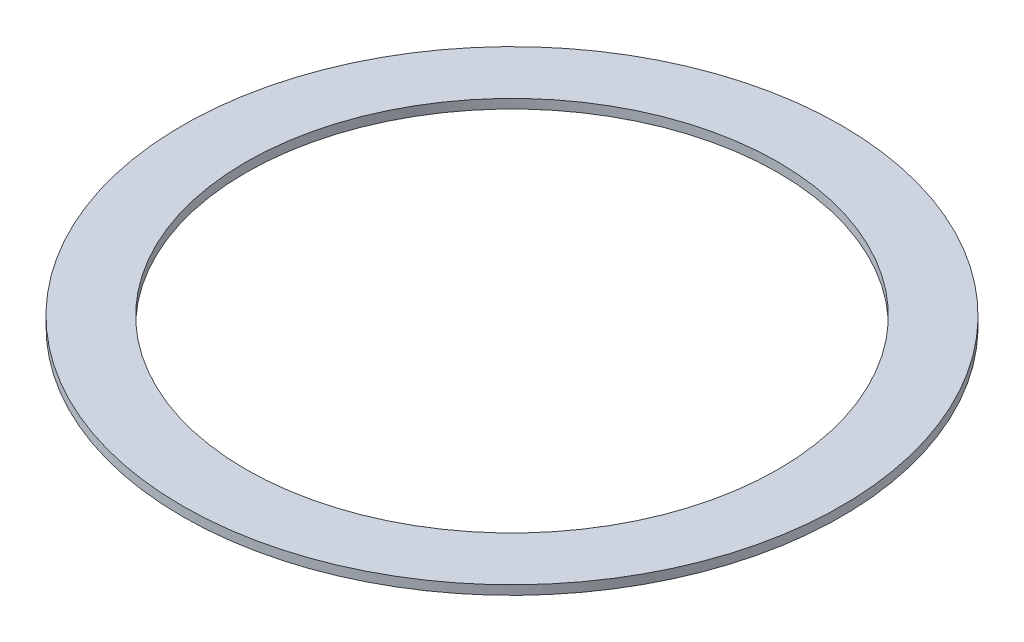
ISO-10303-21;
HEADER;
FILE_DESCRIPTION(('STEP AP214'),'2;1');
FILE_NAME('part.step','',(''),(''),'','','');
FILE_SCHEMA(('AUTOMOTIVE_DESIGN { 1 0 10303 214 1 1 1 1 }'));
ENDSEC;
DATA;
#1=APPLICATION_CONTEXT('core data for automotive mechanical design processes');
#2=APPLICATION_PROTOCOL_DEFINITION('international standard','automotive_design',2000,#1);
#3=PRODUCT_CONTEXT('',#1,'mechanical');
#4=PRODUCT('Part','Part','',(#3));
#5=PRODUCT_RELATED_PRODUCT_CATEGORY('part','',(#4));
#6=PRODUCT_DEFINITION_FORMATION('','',#4);
#7=PRODUCT_DEFINITION_CONTEXT('part definition',#1,'design');
#8=PRODUCT_DEFINITION('design','',#6,#7);
#9=PRODUCT_DEFINITION_SHAPE('','',#8);
#10=(LENGTH_UNIT() NAMED_UNIT(*) SI_UNIT(.MILLI.,.METRE.));
#11=(NAMED_UNIT(*) PLANE_ANGLE_UNIT() SI_UNIT($,.RADIAN.));
#12=(NAMED_UNIT(*) SI_UNIT($,.STERADIAN.) SOLID_ANGLE_UNIT());
#13=UNCERTAINTY_MEASURE_WITH_UNIT(LENGTH_MEASURE(1.E-05),#10,'distance_accuracy_value','');
#14=(GEOMETRIC_REPRESENTATION_CONTEXT(3) GLOBAL_UNCERTAINTY_ASSIGNED_CONTEXT((#13)) GLOBAL_UNIT_ASSIGNED_CONTEXT((#10,
#11,#12)) REPRESENTATION_CONTEXT('',''));
#15=CARTESIAN_POINT('',(0.,0.,0.));
#16=DIRECTION('',(0.,0.,1.));
#17=DIRECTION('',(1.,0.,0.));
#18=AXIS2_PLACEMENT_3D('',#15,#16,#17);
#19=CARTESIAN_POINT('',(0.,10.,0.));
#20=DIRECTION('',(0.,1.,0.));
#21=DIRECTION('',(0.,0.,1.));
#22=AXIS2_PLACEMENT_3D('',#19,#20,#21);
#23=PLANE('',#22);
#24=CARTESIAN_POINT('',(0.,10.,0.));
#25=DIRECTION('',(0.,1.,0.));
#26=DIRECTION('',(0.,0.,1.));
#27=AXIS2_PLACEMENT_3D('',#24,#25,#26);
#28=CIRCLE('',#27,359.096137885452);
#29=CARTESIAN_POINT('',(0.,10.,359.096137885452));
#30=VERTEX_POINT('',#29);
#31=EDGE_CURVE('E10',#30,#30,#28,.T.);
#32=ORIENTED_EDGE('',*,*,#31,.T.);
#33=EDGE_LOOP('',(#32));
#34=FACE_BOUND('',#33,.T.);
#35=CARTESIAN_POINT('',(0.,10.,0.));
#36=DIRECTION('',(0.,1.,0.));
#37=DIRECTION('',(0.,0.,1.));
#38=AXIS2_PLACEMENT_3D('',#35,#36,#37);
#39=CIRCLE('',#38,290.);
#40=CARTESIAN_POINT('',(0.,10.,290.));
#41=VERTEX_POINT('',#40);
#42=EDGE_CURVE('E41',#41,#41,#39,.T.);
#43=ORIENTED_EDGE('',*,*,#42,.F.);
#44=EDGE_LOOP('',(#43));
#45=FACE_BOUND('',#44,.T.);
#46=ADVANCED_FACE('F30',(#34,#45),#23,.T.);
#47=CARTESIAN_POINT('',(0.,0.,0.));
#48=DIRECTION('',(0.,1.,0.));
#49=DIRECTION('',(0.,0.,1.));
#50=AXIS2_PLACEMENT_3D('',#47,#48,#49);
#51=PLANE('',#50);
#52=CARTESIAN_POINT('',(0.,0.,0.));
#53=DIRECTION('',(0.,1.,0.));
#54=DIRECTION('',(0.,0.,1.));
#55=AXIS2_PLACEMENT_3D('',#52,#53,#54);
#56=CIRCLE('',#55,359.096137885452);
#57=CARTESIAN_POINT('',(0.,0.,359.096137885452));
#58=VERTEX_POINT('',#57);
#59=EDGE_CURVE('E34',#58,#58,#56,.T.);
#60=ORIENTED_EDGE('',*,*,#59,.F.);
#61=EDGE_LOOP('',(#60));
#62=FACE_BOUND('',#61,.T.);
#63=CARTESIAN_POINT('',(0.,0.,0.));
#64=DIRECTION('',(0.,1.,0.));
#65=DIRECTION('',(0.,0.,1.));
#66=AXIS2_PLACEMENT_3D('',#63,#64,#65);
#67=CIRCLE('',#66,290.);
#68=CARTESIAN_POINT('',(0.,0.,290.));
#69=VERTEX_POINT('',#68);
#70=EDGE_CURVE('E43',#69,#69,#67,.T.);
#71=ORIENTED_EDGE('',*,*,#70,.T.);
#72=EDGE_LOOP('',(#71));
#73=FACE_BOUND('',#72,.T.);
#74=ADVANCED_FACE('F53',(#62,#73),#51,.F.);
#75=CARTESIAN_POINT('',(0.,10.,0.));
#76=DIRECTION('',(0.,-1.,0.));
#77=DIRECTION('',(0.,0.,-1.));
#78=AXIS2_PLACEMENT_3D('',#75,#76,#77);
#79=CYLINDRICAL_SURFACE('',#78,359.096137885452);
#80=ORIENTED_EDGE('',*,*,#31,.F.);
#81=EDGE_LOOP('',(#80));
#82=FACE_BOUND('',#81,.T.);
#83=ORIENTED_EDGE('',*,*,#59,.T.);
#84=EDGE_LOOP('',(#83));
#85=FACE_BOUND('',#84,.T.);
#86=ADVANCED_FACE('F32',(#82,#85),#79,.T.);
#87=CARTESIAN_POINT('',(0.,10.,0.));
#88=DIRECTION('',(0.,-1.,0.));
#89=DIRECTION('',(0.,0.,-1.));
#90=AXIS2_PLACEMENT_3D('',#87,#88,#89);
#91=CYLINDRICAL_SURFACE('',#90,290.);
#92=ORIENTED_EDGE('',*,*,#42,.T.);
#93=EDGE_LOOP('',(#92));
#94=FACE_BOUND('',#93,.T.);
#95=ORIENTED_EDGE('',*,*,#70,.F.);
#96=EDGE_LOOP('',(#95));
#97=FACE_BOUND('',#96,.T.);
#98=ADVANCED_FACE('F49',(#94,#97),#91,.F.);
#99=CLOSED_SHELL('',(#46,#74,#86,#98));
#100=MANIFOLD_SOLID_BREP('B2',#99);
#101=ADVANCED_BREP_SHAPE_REPRESENTATION('',(#18,#100),#14);
#102=SHAPE_DEFINITION_REPRESENTATION(#9,#101);
ENDSEC;
END-ISO-10303-21;
